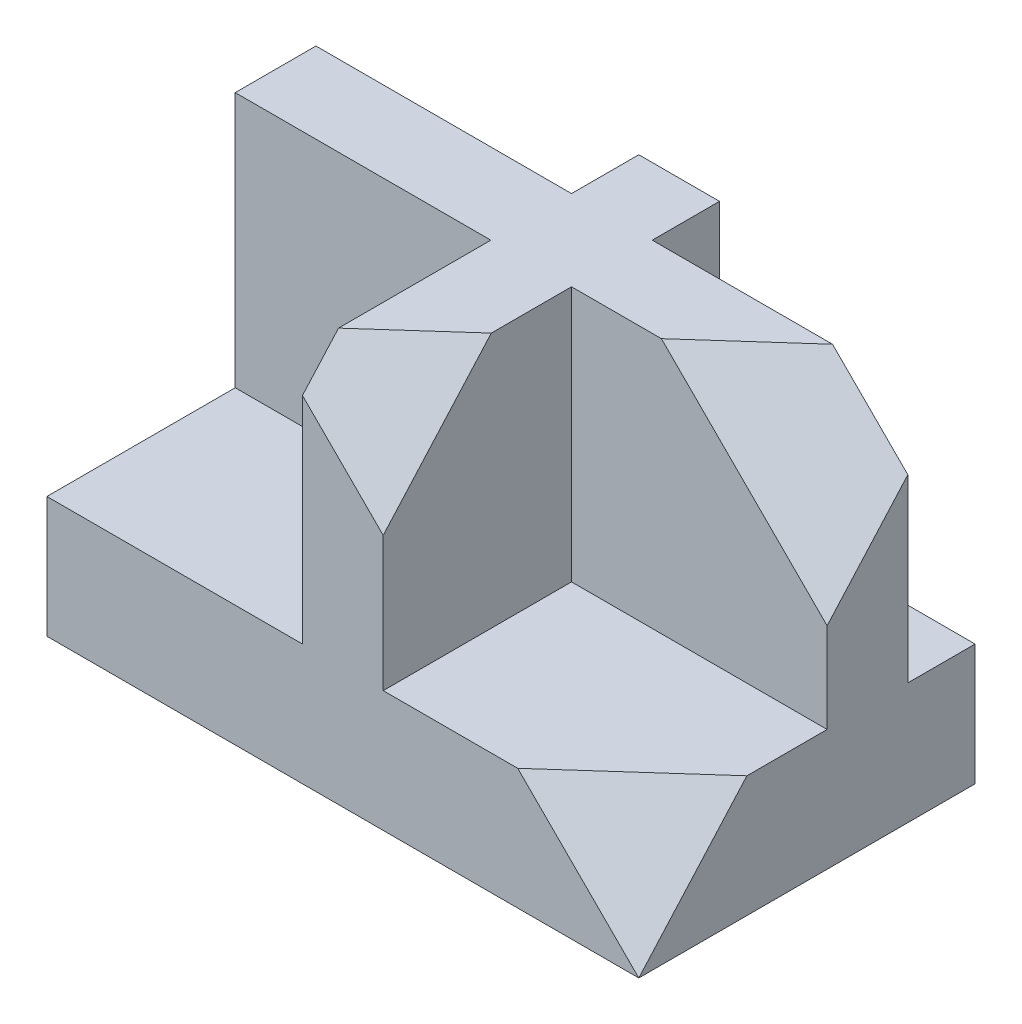
ISO-10303-21;
HEADER;
FILE_DESCRIPTION(('STEP AP214'),'2;1');
FILE_NAME('part.step','',(''),(''),'','','');
FILE_SCHEMA(('AUTOMOTIVE_DESIGN { 1 0 10303 214 1 1 1 1 }'));
ENDSEC;
DATA;
#1=APPLICATION_CONTEXT('core data for automotive mechanical design processes');
#2=APPLICATION_PROTOCOL_DEFINITION('international standard','automotive_design',2000,#1);
#3=PRODUCT_CONTEXT('',#1,'mechanical');
#4=PRODUCT('Part','Part','',(#3));
#5=PRODUCT_RELATED_PRODUCT_CATEGORY('part','',(#4));
#6=PRODUCT_DEFINITION_FORMATION('','',#4);
#7=PRODUCT_DEFINITION_CONTEXT('part definition',#1,'design');
#8=PRODUCT_DEFINITION('design','',#6,#7);
#9=PRODUCT_DEFINITION_SHAPE('','',#8);
#10=(LENGTH_UNIT() NAMED_UNIT(*) SI_UNIT(.MILLI.,.METRE.));
#11=(NAMED_UNIT(*) PLANE_ANGLE_UNIT() SI_UNIT($,.RADIAN.));
#12=(NAMED_UNIT(*) SI_UNIT($,.STERADIAN.) SOLID_ANGLE_UNIT());
#13=UNCERTAINTY_MEASURE_WITH_UNIT(LENGTH_MEASURE(1.E-05),#10,'distance_accuracy_value','');
#14=(GEOMETRIC_REPRESENTATION_CONTEXT(3) GLOBAL_UNCERTAINTY_ASSIGNED_CONTEXT((#13)) GLOBAL_UNIT_ASSIGNED_CONTEXT((#10,
#11,#12)) REPRESENTATION_CONTEXT('',''));
#15=CARTESIAN_POINT('',(0.,0.,0.));
#16=DIRECTION('',(0.,0.,1.));
#17=DIRECTION('',(1.,0.,0.));
#18=AXIS2_PLACEMENT_3D('',#15,#16,#17);
#19=CARTESIAN_POINT('',(0.,18.,0.));
#20=DIRECTION('',(0.,1.,0.));
#21=DIRECTION('',(0.,0.,1.));
#22=AXIS2_PLACEMENT_3D('',#19,#20,#21);
#23=PLANE('',#22);
#24=DIRECTION('',(0.,0.,-1.));
#25=VECTOR('',#24,1.);
#26=CARTESIAN_POINT('',(5.99999999999999,18.,-25.));
#27=LINE('',#26,#25);
#28=CARTESIAN_POINT('',(6.00000000000001,18.,-15.));
#29=VERTEX_POINT('',#28);
#30=CARTESIAN_POINT('',(6.00000000000001,18.,-25.));
#31=VERTEX_POINT('',#30);
#32=EDGE_CURVE('E283',#29,#31,#27,.T.);
#33=ORIENTED_EDGE('',*,*,#32,.F.);
#34=DIRECTION('',(-1.,0.,0.));
#35=VECTOR('',#34,1.);
#36=CARTESIAN_POINT('',(6.00000000000001,18.,-15.));
#37=LINE('',#36,#35);
#38=CARTESIAN_POINT('',(44.,18.,-15.));
#39=VERTEX_POINT('',#38);
#40=EDGE_CURVE('E280',#39,#29,#37,.T.);
#41=ORIENTED_EDGE('',*,*,#40,.F.);
#42=DIRECTION('',(0.,0.,-1.));
#43=VECTOR('',#42,1.);
#44=CARTESIAN_POINT('',(44.,18.,-25.));
#45=LINE('',#44,#43);
#46=CARTESIAN_POINT('',(44.,18.,-25.));
#47=VERTEX_POINT('',#46);
#48=EDGE_CURVE('E198',#39,#47,#45,.T.);
#49=ORIENTED_EDGE('',*,*,#48,.T.);
#50=DIRECTION('',(-1.,0.,0.));
#51=VECTOR('',#50,1.);
#52=CARTESIAN_POINT('',(-44.,18.,-25.));
#53=LINE('',#52,#51);
#54=EDGE_CURVE('E327',#47,#31,#53,.T.);
#55=ORIENTED_EDGE('',*,*,#54,.T.);
#56=EDGE_LOOP('',(#33,#41,#49,#55));
#57=FACE_BOUND('',#56,.T.);
#58=ADVANCED_FACE('F39',(#57),#23,.T.);
#59=DIRECTION('',(-0.745937661625918,0.,0.666015769308848));
#60=VECTOR('',#59,1.);
#61=CARTESIAN_POINT('',(23.9531582682751,18.,26.8275372604684));
#62=LINE('',#61,#60);
#63=CARTESIAN_POINT('',(44.,18.,8.92857142857144));
#64=VERTEX_POINT('',#63);
#65=CARTESIAN_POINT('',(25.9999999999998,18.,25.));
#66=VERTEX_POINT('',#65);
#67=EDGE_CURVE('E55',#64,#66,#62,.T.);
#68=ORIENTED_EDGE('',*,*,#67,.F.);
#69=CARTESIAN_POINT('',(44.,18.,-3.00000000000001));
#70=VERTEX_POINT('',#69);
#71=EDGE_CURVE('E184',#64,#70,#45,.T.);
#72=ORIENTED_EDGE('',*,*,#71,.T.);
#73=DIRECTION('',(1.,0.,0.));
#74=VECTOR('',#73,1.);
#75=CARTESIAN_POINT('',(6.00000000000001,18.,-3.00000000000001));
#76=LINE('',#75,#74);
#77=CARTESIAN_POINT('',(6.00000000000001,18.,-3.00000000000001));
#78=VERTEX_POINT('',#77);
#79=EDGE_CURVE('E276',#78,#70,#76,.T.);
#80=ORIENTED_EDGE('',*,*,#79,.F.);
#81=DIRECTION('',(0.,0.,-1.));
#82=VECTOR('',#81,1.);
#83=CARTESIAN_POINT('',(6.,18.,25.));
#84=LINE('',#83,#82);
#85=CARTESIAN_POINT('',(6.00000000000001,18.,25.));
#86=VERTEX_POINT('',#85);
#87=EDGE_CURVE('E272',#86,#78,#84,.T.);
#88=ORIENTED_EDGE('',*,*,#87,.F.);
#89=DIRECTION('',(1.,0.,0.));
#90=VECTOR('',#89,1.);
#91=CARTESIAN_POINT('',(-44.,18.,25.));
#92=LINE('',#91,#90);
#93=EDGE_CURVE('E332',#86,#66,#92,.T.);
#94=ORIENTED_EDGE('',*,*,#93,.T.);
#95=EDGE_LOOP('',(#68,#72,#80,#88,#94));
#96=FACE_BOUND('',#95,.T.);
#97=ADVANCED_FACE('F425',(#96),#23,.T.);
#98=DIRECTION('',(0.,0.,1.));
#99=VECTOR('',#98,1.);
#100=CARTESIAN_POINT('',(-6.,18.,-3.00000000000001));
#101=LINE('',#100,#99);
#102=CARTESIAN_POINT('',(-6.,18.,-3.00000000000001));
#103=VERTEX_POINT('',#102);
#104=CARTESIAN_POINT('',(-6.,18.,25.));
#105=VERTEX_POINT('',#104);
#106=EDGE_CURVE('E268',#103,#105,#101,.T.);
#107=ORIENTED_EDGE('',*,*,#106,.F.);
#108=DIRECTION('',(1.,0.,0.));
#109=VECTOR('',#108,1.);
#110=CARTESIAN_POINT('',(-44.,18.,-3.00000000000001));
#111=LINE('',#110,#109);
#112=CARTESIAN_POINT('',(-44.,18.,-3.00000000000001));
#113=VERTEX_POINT('',#112);
#114=EDGE_CURVE('E264',#113,#103,#111,.T.);
#115=ORIENTED_EDGE('',*,*,#114,.F.);
#116=DIRECTION('',(0.,0.,1.));
#117=VECTOR('',#116,1.);
#118=CARTESIAN_POINT('',(-44.,18.,-25.));
#119=LINE('',#118,#117);
#120=CARTESIAN_POINT('',(-44.,18.,25.));
#121=VERTEX_POINT('',#120);
#122=EDGE_CURVE('E329',#113,#121,#119,.T.);
#123=ORIENTED_EDGE('',*,*,#122,.T.);
#124=EDGE_CURVE('E214',#121,#105,#92,.T.);
#125=ORIENTED_EDGE('',*,*,#124,.T.);
#126=EDGE_LOOP('',(#107,#115,#123,#125));
#127=FACE_BOUND('',#126,.T.);
#128=ADVANCED_FACE('F340',(#127),#23,.T.);
#129=CARTESIAN_POINT('',(44.,18.,-25.));
#130=DIRECTION('',(-1.,0.,0.));
#131=DIRECTION('',(0.,0.,1.));
#132=AXIS2_PLACEMENT_3D('',#129,#130,#131);
#133=PLANE('',#132);
#134=DIRECTION('',(0.,-1.,0.));
#135=VECTOR('',#134,1.);
#136=CARTESIAN_POINT('',(44.,56.,-15.));
#137=LINE('',#136,#135);
#138=CARTESIAN_POINT('',(44.,44.8,-15.));
#139=VERTEX_POINT('',#138);
#140=EDGE_CURVE('E293',#139,#39,#137,.T.);
#141=ORIENTED_EDGE('',*,*,#140,.F.);
#142=DIRECTION('',(0.,0.745937661625915,-0.666015769308852));
#143=VECTOR('',#142,1.);
#144=CARTESIAN_POINT('',(44.,0.,25.));
#145=LINE('',#144,#143);
#146=CARTESIAN_POINT('',(44.,31.36,-3.));
#147=VERTEX_POINT('',#146);
#148=EDGE_CURVE('E186',#147,#139,#145,.T.);
#149=ORIENTED_EDGE('',*,*,#148,.F.);
#150=DIRECTION('',(0.,-1.,0.));
#151=VECTOR('',#150,1.);
#152=CARTESIAN_POINT('',(44.,56.,-3.00000000000001));
#153=LINE('',#152,#151);
#154=EDGE_CURVE('E296',#147,#70,#153,.T.);
#155=ORIENTED_EDGE('',*,*,#154,.T.);
#156=ORIENTED_EDGE('',*,*,#71,.F.);
#157=CARTESIAN_POINT('',(44.,0.,25.));
#158=VERTEX_POINT('',#157);
#159=EDGE_CURVE('E168',#158,#64,#145,.T.);
#160=ORIENTED_EDGE('',*,*,#159,.F.);
#161=DIRECTION('',(0.,0.,-1.));
#162=VECTOR('',#161,1.);
#163=CARTESIAN_POINT('',(44.,0.,-25.));
#164=LINE('',#163,#162);
#165=CARTESIAN_POINT('',(44.,0.,-25.));
#166=VERTEX_POINT('',#165);
#167=EDGE_CURVE('E182',#158,#166,#164,.T.);
#168=ORIENTED_EDGE('',*,*,#167,.T.);
#169=DIRECTION('',(0.,-1.,0.));
#170=VECTOR('',#169,1.);
#171=CARTESIAN_POINT('',(44.,18.,-25.));
#172=LINE('',#171,#170);
#173=EDGE_CURVE('E224',#47,#166,#172,.T.);
#174=ORIENTED_EDGE('',*,*,#173,.F.);
#175=ORIENTED_EDGE('',*,*,#48,.F.);
#176=EDGE_LOOP('',(#141,#149,#155,#156,#160,#168,#174,#175));
#177=FACE_BOUND('',#176,.T.);
#178=ADVANCED_FACE('F41',(#177),#133,.F.);
#179=CARTESIAN_POINT('',(-44.,18.,-25.));
#180=DIRECTION('',(0.,0.,1.));
#181=DIRECTION('',(1.,0.,0.));
#182=AXIS2_PLACEMENT_3D('',#179,#180,#181);
#183=PLANE('',#182);
#184=DIRECTION('',(-1.,0.,0.));
#185=VECTOR('',#184,1.);
#186=CARTESIAN_POINT('',(-44.,0.,-25.));
#187=LINE('',#186,#185);
#188=CARTESIAN_POINT('',(-44.,0.,-25.));
#189=VERTEX_POINT('',#188);
#190=EDGE_CURVE('E202',#166,#189,#187,.T.);
#191=ORIENTED_EDGE('',*,*,#190,.T.);
#192=DIRECTION('',(0.,-1.,0.));
#193=VECTOR('',#192,1.);
#194=CARTESIAN_POINT('',(-44.,18.,-25.));
#195=LINE('',#194,#193);
#196=CARTESIAN_POINT('',(-44.,18.,-25.));
#197=VERTEX_POINT('',#196);
#198=EDGE_CURVE('E221',#197,#189,#195,.T.);
#199=ORIENTED_EDGE('',*,*,#198,.F.);
#200=CARTESIAN_POINT('',(-6.00000000000001,18.,-25.));
#201=VERTEX_POINT('',#200);
#202=EDGE_CURVE('E326',#201,#197,#53,.T.);
#203=ORIENTED_EDGE('',*,*,#202,.F.);
#204=DIRECTION('',(0.,-1.,0.));
#205=VECTOR('',#204,1.);
#206=CARTESIAN_POINT('',(-6.00000000000001,56.,-25.));
#207=LINE('',#206,#205);
#208=CARTESIAN_POINT('',(-6.00000000000001,56.,-25.));
#209=VERTEX_POINT('',#208);
#210=EDGE_CURVE('E205',#209,#201,#207,.T.);
#211=ORIENTED_EDGE('',*,*,#210,.F.);
#212=DIRECTION('',(-1.,0.,0.));
#213=VECTOR('',#212,1.);
#214=CARTESIAN_POINT('',(-6.00000000000001,56.,-25.));
#215=LINE('',#214,#213);
#216=CARTESIAN_POINT('',(5.99999999999999,56.,-25.));
#217=VERTEX_POINT('',#216);
#218=EDGE_CURVE('E287',#217,#209,#215,.T.);
#219=ORIENTED_EDGE('',*,*,#218,.F.);
#220=DIRECTION('',(0.,-1.,0.));
#221=VECTOR('',#220,1.);
#222=CARTESIAN_POINT('',(5.99999999999999,56.,-25.));
#223=LINE('',#222,#221);
#224=EDGE_CURVE('E250',#217,#31,#223,.T.);
#225=ORIENTED_EDGE('',*,*,#224,.T.);
#226=ORIENTED_EDGE('',*,*,#54,.F.);
#227=ORIENTED_EDGE('',*,*,#173,.T.);
#228=EDGE_LOOP('',(#191,#199,#203,#211,#219,#225,#226,#227));
#229=FACE_BOUND('',#228,.T.);
#230=ADVANCED_FACE('F411',(#229),#183,.F.);
#231=CARTESIAN_POINT('',(-44.,18.,-25.));
#232=DIRECTION('',(1.,0.,0.));
#233=DIRECTION('',(0.,0.,-1.));
#234=AXIS2_PLACEMENT_3D('',#231,#232,#233);
#235=PLANE('',#234);
#236=DIRECTION('',(0.,0.,1.));
#237=VECTOR('',#236,1.);
#238=CARTESIAN_POINT('',(-44.,0.,-25.));
#239=LINE('',#238,#237);
#240=CARTESIAN_POINT('',(-44.,0.,25.));
#241=VERTEX_POINT('',#240);
#242=EDGE_CURVE('E199',#189,#241,#239,.T.);
#243=ORIENTED_EDGE('',*,*,#242,.T.);
#244=DIRECTION('',(0.,-1.,0.));
#245=VECTOR('',#244,1.);
#246=CARTESIAN_POINT('',(-44.,18.,25.));
#247=LINE('',#246,#245);
#248=EDGE_CURVE('E194',#121,#241,#247,.T.);
#249=ORIENTED_EDGE('',*,*,#248,.F.);
#250=ORIENTED_EDGE('',*,*,#122,.F.);
#251=DIRECTION('',(0.,-1.,0.));
#252=VECTOR('',#251,1.);
#253=CARTESIAN_POINT('',(-44.,56.,-3.00000000000001));
#254=LINE('',#253,#252);
#255=CARTESIAN_POINT('',(-44.,56.,-3.00000000000001));
#256=VERTEX_POINT('',#255);
#257=EDGE_CURVE('E313',#256,#113,#254,.T.);
#258=ORIENTED_EDGE('',*,*,#257,.F.);
#259=DIRECTION('',(0.,0.,1.));
#260=VECTOR('',#259,1.);
#261=CARTESIAN_POINT('',(-44.,56.,-15.));
#262=LINE('',#261,#260);
#263=CARTESIAN_POINT('',(-44.,56.,-15.));
#264=VERTEX_POINT('',#263);
#265=EDGE_CURVE('E359',#264,#256,#262,.T.);
#266=ORIENTED_EDGE('',*,*,#265,.F.);
#267=DIRECTION('',(0.,-1.,0.));
#268=VECTOR('',#267,1.);
#269=CARTESIAN_POINT('',(-44.,56.,-15.));
#270=LINE('',#269,#268);
#271=CARTESIAN_POINT('',(-44.,18.,-15.));
#272=VERTEX_POINT('',#271);
#273=EDGE_CURVE('E317',#264,#272,#270,.T.);
#274=ORIENTED_EDGE('',*,*,#273,.T.);
#275=EDGE_CURVE('E330',#197,#272,#119,.T.);
#276=ORIENTED_EDGE('',*,*,#275,.F.);
#277=ORIENTED_EDGE('',*,*,#198,.T.);
#278=EDGE_LOOP('',(#243,#249,#250,#258,#266,#274,#276,#277));
#279=FACE_BOUND('',#278,.T.);
#280=ADVANCED_FACE('F343',(#279),#235,.F.);
#281=CARTESIAN_POINT('',(-44.,18.,25.));
#282=DIRECTION('',(0.,0.,-1.));
#283=DIRECTION('',(-1.,0.,0.));
#284=AXIS2_PLACEMENT_3D('',#281,#282,#283);
#285=PLANE('',#284);
#286=DIRECTION('',(1.,0.,0.));
#287=VECTOR('',#286,1.);
#288=CARTESIAN_POINT('',(-44.,0.,25.));
#289=LINE('',#288,#287);
#290=EDGE_CURVE('E190',#241,#158,#289,.T.);
#291=ORIENTED_EDGE('',*,*,#290,.T.);
#292=DIRECTION('',(0.707106781186551,-0.707106781186543,0.));
#293=VECTOR('',#292,1.);
#294=CARTESIAN_POINT('',(-12.0000000000006,56.,25.));
#295=LINE('',#294,#293);
#296=EDGE_CURVE('E165',#66,#158,#295,.T.);
#297=ORIENTED_EDGE('',*,*,#296,.F.);
#298=ORIENTED_EDGE('',*,*,#93,.F.);
#299=DIRECTION('',(0.,-1.,0.));
#300=VECTOR('',#299,1.);
#301=CARTESIAN_POINT('',(6.,56.,25.));
#302=LINE('',#301,#300);
#303=CARTESIAN_POINT('',(6.,37.9999999999996,25.));
#304=VERTEX_POINT('',#303);
#305=EDGE_CURVE('E303',#304,#86,#302,.T.);
#306=ORIENTED_EDGE('',*,*,#305,.F.);
#307=CARTESIAN_POINT('',(-5.99999999999999,49.9999999999994,25.));
#308=VERTEX_POINT('',#307);
#309=EDGE_CURVE('E174',#308,#304,#295,.T.);
#310=ORIENTED_EDGE('',*,*,#309,.F.);
#311=DIRECTION('',(0.,-1.,0.));
#312=VECTOR('',#311,1.);
#313=CARTESIAN_POINT('',(-6.,56.,25.));
#314=LINE('',#313,#312);
#315=EDGE_CURVE('E306',#308,#105,#314,.T.);
#316=ORIENTED_EDGE('',*,*,#315,.T.);
#317=ORIENTED_EDGE('',*,*,#124,.F.);
#318=ORIENTED_EDGE('',*,*,#248,.T.);
#319=EDGE_LOOP('',(#291,#297,#298,#306,#310,#316,#317,#318));
#320=FACE_BOUND('',#319,.T.);
#321=ADVANCED_FACE('F191',(#320),#285,.F.);
#322=DIRECTION('',(-1.,0.,0.));
#323=VECTOR('',#322,1.);
#324=CARTESIAN_POINT('',(-6.,18.,-15.));
#325=LINE('',#324,#323);
#326=CARTESIAN_POINT('',(-6.,18.,-15.));
#327=VERTEX_POINT('',#326);
#328=EDGE_CURVE('E260',#327,#272,#325,.T.);
#329=ORIENTED_EDGE('',*,*,#328,.F.);
#330=DIRECTION('',(0.,0.,1.));
#331=VECTOR('',#330,1.);
#332=CARTESIAN_POINT('',(-6.00000000000001,18.,-25.));
#333=LINE('',#332,#331);
#334=EDGE_CURVE('E256',#201,#327,#333,.T.);
#335=ORIENTED_EDGE('',*,*,#334,.F.);
#336=ORIENTED_EDGE('',*,*,#202,.T.);
#337=ORIENTED_EDGE('',*,*,#275,.T.);
#338=EDGE_LOOP('',(#329,#335,#336,#337));
#339=FACE_BOUND('',#338,.T.);
#340=ADVANCED_FACE('F408',(#339),#23,.T.);
#341=CARTESIAN_POINT('',(0.,0.,0.));
#342=DIRECTION('',(0.,1.,0.));
#343=DIRECTION('',(0.,0.,1.));
#344=AXIS2_PLACEMENT_3D('',#341,#342,#343);
#345=PLANE('',#344);
#346=ORIENTED_EDGE('',*,*,#167,.F.);
#347=ORIENTED_EDGE('',*,*,#290,.F.);
#348=ORIENTED_EDGE('',*,*,#242,.F.);
#349=ORIENTED_EDGE('',*,*,#190,.F.);
#350=EDGE_LOOP('',(#346,#347,#348,#349));
#351=FACE_BOUND('',#350,.T.);
#352=ADVANCED_FACE('F201',(#351),#345,.F.);
#353=CARTESIAN_POINT('',(-6.00000000000001,56.,-25.));
#354=DIRECTION('',(1.,0.,0.));
#355=DIRECTION('',(0.,0.,-1.));
#356=AXIS2_PLACEMENT_3D('',#353,#354,#355);
#357=PLANE('',#356);
#358=ORIENTED_EDGE('',*,*,#334,.T.);
#359=DIRECTION('',(0.,-1.,0.));
#360=VECTOR('',#359,1.);
#361=CARTESIAN_POINT('',(-6.,56.,-15.));
#362=LINE('',#361,#360);
#363=CARTESIAN_POINT('',(-6.,56.,-15.));
#364=VERTEX_POINT('',#363);
#365=EDGE_CURVE('E211',#364,#327,#362,.T.);
#366=ORIENTED_EDGE('',*,*,#365,.F.);
#367=DIRECTION('',(0.,0.,1.));
#368=VECTOR('',#367,1.);
#369=CARTESIAN_POINT('',(-6.00000000000001,56.,-25.));
#370=LINE('',#369,#368);
#371=EDGE_CURVE('E368',#209,#364,#370,.T.);
#372=ORIENTED_EDGE('',*,*,#371,.F.);
#373=ORIENTED_EDGE('',*,*,#210,.T.);
#374=EDGE_LOOP('',(#358,#366,#372,#373));
#375=FACE_BOUND('',#374,.T.);
#376=ADVANCED_FACE('F405',(#375),#357,.F.);
#377=CARTESIAN_POINT('',(-6.,56.,-15.));
#378=DIRECTION('',(0.,0.,1.));
#379=DIRECTION('',(1.,0.,0.));
#380=AXIS2_PLACEMENT_3D('',#377,#378,#379);
#381=PLANE('',#380);
#382=ORIENTED_EDGE('',*,*,#328,.T.);
#383=ORIENTED_EDGE('',*,*,#273,.F.);
#384=DIRECTION('',(-1.,0.,0.));
#385=VECTOR('',#384,1.);
#386=CARTESIAN_POINT('',(-6.,56.,-15.));
#387=LINE('',#386,#385);
#388=EDGE_CURVE('E362',#364,#264,#387,.T.);
#389=ORIENTED_EDGE('',*,*,#388,.F.);
#390=ORIENTED_EDGE('',*,*,#365,.T.);
#391=EDGE_LOOP('',(#382,#383,#389,#390));
#392=FACE_BOUND('',#391,.T.);
#393=ADVANCED_FACE('F407',(#392),#381,.F.);
#394=CARTESIAN_POINT('',(-44.,56.,-3.00000000000001));
#395=DIRECTION('',(0.,0.,-1.));
#396=DIRECTION('',(-1.,0.,0.));
#397=AXIS2_PLACEMENT_3D('',#394,#395,#396);
#398=PLANE('',#397);
#399=ORIENTED_EDGE('',*,*,#114,.T.);
#400=DIRECTION('',(0.,-1.,0.));
#401=VECTOR('',#400,1.);
#402=CARTESIAN_POINT('',(-6.,56.,-3.00000000000001));
#403=LINE('',#402,#401);
#404=CARTESIAN_POINT('',(-6.,56.,-3.00000000000001));
#405=VERTEX_POINT('',#404);
#406=EDGE_CURVE('E309',#405,#103,#403,.T.);
#407=ORIENTED_EDGE('',*,*,#406,.F.);
#408=DIRECTION('',(1.,0.,0.));
#409=VECTOR('',#408,1.);
#410=CARTESIAN_POINT('',(-44.,56.,-3.00000000000001));
#411=LINE('',#410,#409);
#412=EDGE_CURVE('E357',#256,#405,#411,.T.);
#413=ORIENTED_EDGE('',*,*,#412,.F.);
#414=ORIENTED_EDGE('',*,*,#257,.T.);
#415=EDGE_LOOP('',(#399,#407,#413,#414));
#416=FACE_BOUND('',#415,.T.);
#417=ADVANCED_FACE('F355',(#416),#398,.F.);
#418=CARTESIAN_POINT('',(-6.,56.,-3.00000000000001));
#419=DIRECTION('',(1.,0.,0.));
#420=DIRECTION('',(0.,0.,-1.));
#421=AXIS2_PLACEMENT_3D('',#418,#419,#420);
#422=PLANE('',#421);
#423=ORIENTED_EDGE('',*,*,#315,.F.);
#424=DIRECTION('',(0.,0.745937661625915,-0.666015769308852));
#425=VECTOR('',#424,1.);
#426=CARTESIAN_POINT('',(-6.,67.2491128459898,9.59900638750859));
#427=LINE('',#426,#425);
#428=CARTESIAN_POINT('',(-5.99999999999998,56.,19.6428571428566));
#429=VERTEX_POINT('',#428);
#430=EDGE_CURVE('E352',#308,#429,#427,.T.);
#431=ORIENTED_EDGE('',*,*,#430,.T.);
#432=DIRECTION('',(0.,0.,1.));
#433=VECTOR('',#432,1.);
#434=CARTESIAN_POINT('',(-6.,56.,-3.00000000000001));
#435=LINE('',#434,#433);
#436=EDGE_CURVE('E366',#405,#429,#435,.T.);
#437=ORIENTED_EDGE('',*,*,#436,.F.);
#438=ORIENTED_EDGE('',*,*,#406,.T.);
#439=ORIENTED_EDGE('',*,*,#106,.T.);
#440=EDGE_LOOP('',(#423,#431,#437,#438,#439));
#441=FACE_BOUND('',#440,.T.);
#442=ADVANCED_FACE('F350',(#441),#422,.F.);
#443=CARTESIAN_POINT('',(6.,56.,25.));
#444=DIRECTION('',(-1.,0.,0.));
#445=DIRECTION('',(0.,0.,1.));
#446=AXIS2_PLACEMENT_3D('',#443,#444,#445);
#447=PLANE('',#446);
#448=DIRECTION('',(0.,0.,-1.));
#449=VECTOR('',#448,1.);
#450=CARTESIAN_POINT('',(6.,56.,25.));
#451=LINE('',#450,#449);
#452=CARTESIAN_POINT('',(6.,56.,8.92857142857104));
#453=VERTEX_POINT('',#452);
#454=CARTESIAN_POINT('',(6.00000000000001,56.,-3.00000000000001));
#455=VERTEX_POINT('',#454);
#456=EDGE_CURVE('E252',#453,#455,#451,.T.);
#457=ORIENTED_EDGE('',*,*,#456,.F.);
#458=DIRECTION('',(0.,-0.745937661625915,0.666015769308852));
#459=VECTOR('',#458,1.);
#460=CARTESIAN_POINT('',(6.,48.0156139105747,16.0574875798436));
#461=LINE('',#460,#459);
#462=EDGE_CURVE('E386',#453,#304,#461,.T.);
#463=ORIENTED_EDGE('',*,*,#462,.T.);
#464=ORIENTED_EDGE('',*,*,#305,.T.);
#465=ORIENTED_EDGE('',*,*,#87,.T.);
#466=DIRECTION('',(0.,-1.,0.));
#467=VECTOR('',#466,1.);
#468=CARTESIAN_POINT('',(6.00000000000001,56.,-3.00000000000001));
#469=LINE('',#468,#467);
#470=EDGE_CURVE('E299',#455,#78,#469,.T.);
#471=ORIENTED_EDGE('',*,*,#470,.F.);
#472=EDGE_LOOP('',(#457,#463,#464,#465,#471));
#473=FACE_BOUND('',#472,.T.);
#474=ADVANCED_FACE('F378',(#473),#447,.F.);
#475=CARTESIAN_POINT('',(6.00000000000001,56.,-3.00000000000001));
#476=DIRECTION('',(0.,0.,-1.));
#477=DIRECTION('',(-1.,0.,0.));
#478=AXIS2_PLACEMENT_3D('',#475,#476,#477);
#479=PLANE('',#478);
#480=ORIENTED_EDGE('',*,*,#154,.F.);
#481=DIRECTION('',(-0.707106781186552,0.707106781186543,0.));
#482=VECTOR('',#481,1.);
#483=CARTESIAN_POINT('',(12.6799999999998,62.6799999999999,-3.00000000000001));
#484=LINE('',#483,#482);
#485=CARTESIAN_POINT('',(19.3599999999997,56.,-3.));
#486=VERTEX_POINT('',#485);
#487=EDGE_CURVE('E383',#147,#486,#484,.T.);
#488=ORIENTED_EDGE('',*,*,#487,.T.);
#489=DIRECTION('',(1.,0.,0.));
#490=VECTOR('',#489,1.);
#491=CARTESIAN_POINT('',(6.00000000000001,56.,-3.00000000000001));
#492=LINE('',#491,#490);
#493=EDGE_CURVE('E237',#455,#486,#492,.T.);
#494=ORIENTED_EDGE('',*,*,#493,.F.);
#495=ORIENTED_EDGE('',*,*,#470,.T.);
#496=ORIENTED_EDGE('',*,*,#79,.T.);
#497=EDGE_LOOP('',(#480,#488,#494,#495,#496));
#498=FACE_BOUND('',#497,.T.);
#499=ADVANCED_FACE('F382',(#498),#479,.F.);
#500=CARTESIAN_POINT('',(6.00000000000001,56.,-15.));
#501=DIRECTION('',(0.,0.,1.));
#502=DIRECTION('',(1.,0.,0.));
#503=AXIS2_PLACEMENT_3D('',#500,#501,#502);
#504=PLANE('',#503);
#505=DIRECTION('',(-1.,0.,0.));
#506=VECTOR('',#505,1.);
#507=CARTESIAN_POINT('',(6.00000000000001,56.,-15.));
#508=LINE('',#507,#506);
#509=CARTESIAN_POINT('',(32.7999999999999,56.,-15.));
#510=VERTEX_POINT('',#509);
#511=CARTESIAN_POINT('',(6.00000000000001,56.,-15.));
#512=VERTEX_POINT('',#511);
#513=EDGE_CURVE('E234',#510,#512,#508,.T.);
#514=ORIENTED_EDGE('',*,*,#513,.F.);
#515=DIRECTION('',(0.707106781186552,-0.707106781186543,0.));
#516=VECTOR('',#515,1.);
#517=CARTESIAN_POINT('',(19.3999999999998,69.3999999999999,-15.));
#518=LINE('',#517,#516);
#519=EDGE_CURVE('E63',#510,#139,#518,.T.);
#520=ORIENTED_EDGE('',*,*,#519,.T.);
#521=ORIENTED_EDGE('',*,*,#140,.T.);
#522=ORIENTED_EDGE('',*,*,#40,.T.);
#523=DIRECTION('',(0.,-1.,0.));
#524=VECTOR('',#523,1.);
#525=CARTESIAN_POINT('',(6.00000000000001,56.,-15.));
#526=LINE('',#525,#524);
#527=EDGE_CURVE('E243',#512,#29,#526,.T.);
#528=ORIENTED_EDGE('',*,*,#527,.F.);
#529=EDGE_LOOP('',(#514,#520,#521,#522,#528));
#530=FACE_BOUND('',#529,.T.);
#531=ADVANCED_FACE('F240',(#530),#504,.F.);
#532=CARTESIAN_POINT('',(5.99999999999999,56.,-25.));
#533=DIRECTION('',(-1.,0.,0.));
#534=DIRECTION('',(0.,0.,1.));
#535=AXIS2_PLACEMENT_3D('',#532,#533,#534);
#536=PLANE('',#535);
#537=ORIENTED_EDGE('',*,*,#32,.T.);
#538=ORIENTED_EDGE('',*,*,#224,.F.);
#539=DIRECTION('',(0.,0.,-1.));
#540=VECTOR('',#539,1.);
#541=CARTESIAN_POINT('',(5.99999999999999,56.,-25.));
#542=LINE('',#541,#540);
#543=EDGE_CURVE('E246',#512,#217,#542,.T.);
#544=ORIENTED_EDGE('',*,*,#543,.F.);
#545=ORIENTED_EDGE('',*,*,#527,.T.);
#546=EDGE_LOOP('',(#537,#538,#544,#545));
#547=FACE_BOUND('',#546,.T.);
#548=ADVANCED_FACE('F419',(#547),#536,.F.);
#549=CARTESIAN_POINT('',(0.,56.,0.));
#550=DIRECTION('',(0.,-1.,0.));
#551=DIRECTION('',(0.,0.,-1.));
#552=AXIS2_PLACEMENT_3D('',#549,#550,#551);
#553=PLANE('',#552);
#554=ORIENTED_EDGE('',*,*,#436,.T.);
#555=DIRECTION('',(0.745937661625918,0.,-0.666015769308848));
#556=VECTOR('',#555,1.);
#557=CARTESIAN_POINT('',(7.09723207948877,56.,7.94889992902752));
#558=LINE('',#557,#556);
#559=EDGE_CURVE('E11',#429,#453,#558,.T.);
#560=ORIENTED_EDGE('',*,*,#559,.T.);
#561=ORIENTED_EDGE('',*,*,#456,.T.);
#562=ORIENTED_EDGE('',*,*,#493,.T.);
#563=EDGE_CURVE('E43',#486,#510,#558,.T.);
#564=ORIENTED_EDGE('',*,*,#563,.T.);
#565=ORIENTED_EDGE('',*,*,#513,.T.);
#566=ORIENTED_EDGE('',*,*,#543,.T.);
#567=ORIENTED_EDGE('',*,*,#218,.T.);
#568=ORIENTED_EDGE('',*,*,#371,.T.);
#569=ORIENTED_EDGE('',*,*,#388,.T.);
#570=ORIENTED_EDGE('',*,*,#265,.T.);
#571=ORIENTED_EDGE('',*,*,#412,.T.);
#572=EDGE_LOOP('',(#554,#560,#561,#562,#564,#565,#566,#567,#568,#569,#570,#571));
#573=FACE_BOUND('',#572,.T.);
#574=ADVANCED_FACE('F233',(#573),#553,.F.);
#575=CARTESIAN_POINT('',(22.1238938053095,22.1238938053097,24.7787610619469));
#576=DIRECTION('',(-0.554325087698112,-0.554325087698118,-0.620844098221892));
#577=DIRECTION('',(0.,0.745937661625915,-0.666015769308852));
#578=AXIS2_PLACEMENT_3D('',#575,#576,#577);
#579=PLANE('',#578);
#580=ORIENTED_EDGE('',*,*,#148,.T.);
#581=ORIENTED_EDGE('',*,*,#519,.F.);
#582=ORIENTED_EDGE('',*,*,#563,.F.);
#583=ORIENTED_EDGE('',*,*,#487,.F.);
#584=EDGE_LOOP('',(#580,#581,#582,#583));
#585=FACE_BOUND('',#584,.T.);
#586=ADVANCED_FACE('F573',(#585),#579,.F.);
#587=ORIENTED_EDGE('',*,*,#309,.T.);
#588=ORIENTED_EDGE('',*,*,#462,.F.);
#589=ORIENTED_EDGE('',*,*,#559,.F.);
#590=ORIENTED_EDGE('',*,*,#430,.F.);
#591=EDGE_LOOP('',(#587,#588,#589,#590));
#592=FACE_BOUND('',#591,.T.);
#593=ADVANCED_FACE('F423',(#592),#579,.F.);
#594=ORIENTED_EDGE('',*,*,#67,.T.);
#595=ORIENTED_EDGE('',*,*,#296,.T.);
#596=ORIENTED_EDGE('',*,*,#159,.T.);
#597=EDGE_LOOP('',(#594,#595,#596));
#598=FACE_BOUND('',#597,.T.);
#599=ADVANCED_FACE('F167',(#598),#579,.F.);
#600=CLOSED_SHELL('',(#58,#97,#128,#178,#230,#280,#321,#340,#352,#376,#393,#417,#442,#474,#499,
#531,#548,#574,#586,#593,#599));
#601=MANIFOLD_SOLID_BREP('B2',#600);
#602=ADVANCED_BREP_SHAPE_REPRESENTATION('',(#18,#601),#14);
#603=SHAPE_DEFINITION_REPRESENTATION(#9,#602);
ENDSEC;
END-ISO-10303-21;
